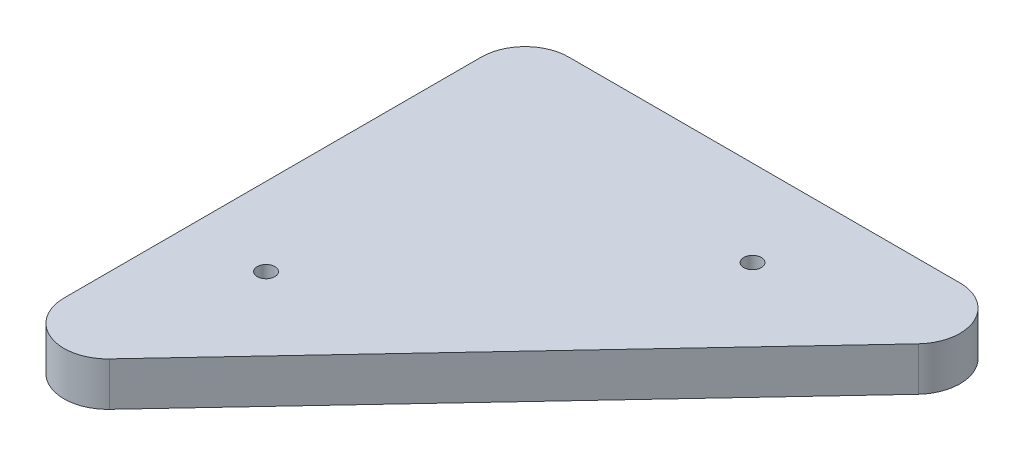
ISO-10303-21;
HEADER;
FILE_DESCRIPTION(('STEP AP214'),'2;1');
FILE_NAME('part.step','',(''),(''),'','','');
FILE_SCHEMA(('AUTOMOTIVE_DESIGN { 1 0 10303 214 1 1 1 1 }'));
ENDSEC;
DATA;
#1=APPLICATION_CONTEXT('core data for automotive mechanical design processes');
#2=APPLICATION_PROTOCOL_DEFINITION('international standard','automotive_design',2000,#1);
#3=PRODUCT_CONTEXT('',#1,'mechanical');
#4=PRODUCT('Part','Part','',(#3));
#5=PRODUCT_RELATED_PRODUCT_CATEGORY('part','',(#4));
#6=PRODUCT_DEFINITION_FORMATION('','',#4);
#7=PRODUCT_DEFINITION_CONTEXT('part definition',#1,'design');
#8=PRODUCT_DEFINITION('design','',#6,#7);
#9=PRODUCT_DEFINITION_SHAPE('','',#8);
#10=(LENGTH_UNIT() NAMED_UNIT(*) SI_UNIT(.MILLI.,.METRE.));
#11=(NAMED_UNIT(*) PLANE_ANGLE_UNIT() SI_UNIT($,.RADIAN.));
#12=(NAMED_UNIT(*) SI_UNIT($,.STERADIAN.) SOLID_ANGLE_UNIT());
#13=UNCERTAINTY_MEASURE_WITH_UNIT(LENGTH_MEASURE(1.E-05),#10,'distance_accuracy_value','');
#14=(GEOMETRIC_REPRESENTATION_CONTEXT(3) GLOBAL_UNCERTAINTY_ASSIGNED_CONTEXT((#13)) GLOBAL_UNIT_ASSIGNED_CONTEXT((#10,
#11,#12)) REPRESENTATION_CONTEXT('',''));
#15=CARTESIAN_POINT('',(0.,0.,0.));
#16=DIRECTION('',(0.,0.,1.));
#17=DIRECTION('',(1.,0.,0.));
#18=AXIS2_PLACEMENT_3D('',#15,#16,#17);
#19=CARTESIAN_POINT('',(0.,12.7,-121.25));
#20=DIRECTION('',(0.,-1.,0.));
#21=DIRECTION('',(0.,0.,-1.));
#22=AXIS2_PLACEMENT_3D('',#19,#20,#21);
#23=CYLINDRICAL_SURFACE('',#22,12.7);
#24=CARTESIAN_POINT('',(0.,0.,-121.25));
#25=DIRECTION('',(0.,1.,0.));
#26=DIRECTION('',(0.,0.,1.));
#27=AXIS2_PLACEMENT_3D('',#24,#25,#26);
#28=CIRCLE('',#27,12.7);
#29=CARTESIAN_POINT('',(0.,0.,-133.95));
#30=VERTEX_POINT('',#29);
#31=CARTESIAN_POINT('',(-12.7,0.,-121.25));
#32=VERTEX_POINT('',#31);
#33=EDGE_CURVE('E119',#30,#32,#28,.T.);
#34=ORIENTED_EDGE('',*,*,#33,.T.);
#35=DIRECTION('',(0.,-1.,0.));
#36=VECTOR('',#35,1.);
#37=CARTESIAN_POINT('',(-12.7,12.7,-121.25));
#38=LINE('',#37,#36);
#39=CARTESIAN_POINT('',(-12.7,12.7,-121.25));
#40=VERTEX_POINT('',#39);
#41=EDGE_CURVE('E11',#40,#32,#38,.T.);
#42=ORIENTED_EDGE('',*,*,#41,.F.);
#43=CARTESIAN_POINT('',(0.,12.7,-121.25));
#44=DIRECTION('',(0.,1.,0.));
#45=DIRECTION('',(0.,0.,1.));
#46=AXIS2_PLACEMENT_3D('',#43,#44,#45);
#47=CIRCLE('',#46,12.7);
#48=CARTESIAN_POINT('',(0.,12.7,-133.95));
#49=VERTEX_POINT('',#48);
#50=EDGE_CURVE('E130',#49,#40,#47,.T.);
#51=ORIENTED_EDGE('',*,*,#50,.F.);
#52=DIRECTION('',(0.,-1.,0.));
#53=VECTOR('',#52,1.);
#54=CARTESIAN_POINT('',(0.,12.7,-133.95));
#55=LINE('',#54,#53);
#56=EDGE_CURVE('E115',#49,#30,#55,.T.);
#57=ORIENTED_EDGE('',*,*,#56,.T.);
#58=EDGE_LOOP('',(#34,#42,#51,#57));
#59=FACE_BOUND('',#58,.T.);
#60=ADVANCED_FACE('F35',(#59),#23,.T.);
#61=CARTESIAN_POINT('',(-12.7,12.7,-121.25));
#62=DIRECTION('',(1.,0.,0.));
#63=DIRECTION('',(0.,0.,-1.));
#64=AXIS2_PLACEMENT_3D('',#61,#62,#63);
#65=PLANE('',#64);
#66=DIRECTION('',(0.,0.,1.));
#67=VECTOR('',#66,1.);
#68=CARTESIAN_POINT('',(-12.7,0.,-121.25));
#69=LINE('',#68,#67);
#70=CARTESIAN_POINT('',(-12.7,0.,0.));
#71=VERTEX_POINT('',#70);
#72=EDGE_CURVE('E122',#32,#71,#69,.T.);
#73=ORIENTED_EDGE('',*,*,#72,.T.);
#74=DIRECTION('',(0.,-1.,0.));
#75=VECTOR('',#74,1.);
#76=CARTESIAN_POINT('',(-12.7,12.7,0.));
#77=LINE('',#76,#75);
#78=CARTESIAN_POINT('',(-12.7,12.7,0.));
#79=VERTEX_POINT('',#78);
#80=EDGE_CURVE('E43',#79,#71,#77,.T.);
#81=ORIENTED_EDGE('',*,*,#80,.F.);
#82=DIRECTION('',(0.,0.,1.));
#83=VECTOR('',#82,1.);
#84=CARTESIAN_POINT('',(-12.7,12.7,-121.25));
#85=LINE('',#84,#83);
#86=EDGE_CURVE('E88',#40,#79,#85,.T.);
#87=ORIENTED_EDGE('',*,*,#86,.F.);
#88=ORIENTED_EDGE('',*,*,#41,.T.);
#89=EDGE_LOOP('',(#73,#81,#87,#88));
#90=FACE_BOUND('',#89,.T.);
#91=ADVANCED_FACE('F156',(#90),#65,.F.);
#92=CARTESIAN_POINT('',(0.,12.7,0.));
#93=DIRECTION('',(0.,-1.,0.));
#94=DIRECTION('',(0.,0.,-1.));
#95=AXIS2_PLACEMENT_3D('',#92,#93,#94);
#96=CYLINDRICAL_SURFACE('',#95,12.7);
#97=CARTESIAN_POINT('',(0.,0.,0.));
#98=DIRECTION('',(0.,1.,0.));
#99=DIRECTION('',(0.,0.,1.));
#100=AXIS2_PLACEMENT_3D('',#97,#98,#99);
#101=CIRCLE('',#100,12.7);
#102=CARTESIAN_POINT('',(9.26519398142731,0.,8.68597608139252));
#103=VERTEX_POINT('',#102);
#104=EDGE_CURVE('E125',#71,#103,#101,.T.);
#105=ORIENTED_EDGE('',*,*,#104,.T.);
#106=DIRECTION('',(0.,-1.,0.));
#107=VECTOR('',#106,1.);
#108=CARTESIAN_POINT('',(9.26519398142731,12.7,8.68597608139252));
#109=LINE('',#108,#107);
#110=CARTESIAN_POINT('',(9.26519398142731,12.7,8.68597608139252));
#111=VERTEX_POINT('',#110);
#112=EDGE_CURVE('E110',#111,#103,#109,.T.);
#113=ORIENTED_EDGE('',*,*,#112,.F.);
#114=CARTESIAN_POINT('',(0.,12.7,0.));
#115=DIRECTION('',(0.,1.,0.));
#116=DIRECTION('',(0.,0.,1.));
#117=AXIS2_PLACEMENT_3D('',#114,#115,#116);
#118=CIRCLE('',#117,12.7);
#119=EDGE_CURVE('E101',#79,#111,#118,.T.);
#120=ORIENTED_EDGE('',*,*,#119,.F.);
#121=ORIENTED_EDGE('',*,*,#80,.T.);
#122=EDGE_LOOP('',(#105,#113,#120,#121));
#123=FACE_BOUND('',#122,.T.);
#124=ADVANCED_FACE('F136',(#123),#96,.T.);
#125=CARTESIAN_POINT('',(9.26519398142731,12.7,8.68597608139252));
#126=DIRECTION('',(-0.729542833183253,0.,-0.683935124519096));
#127=DIRECTION('',(-0.683935124519096,0.,0.729542833183253));
#128=AXIS2_PLACEMENT_3D('',#125,#126,#127);
#129=PLANE('',#128);
#130=DIRECTION('',(0.683935124519096,0.,-0.729542833183253));
#131=VECTOR('',#130,1.);
#132=CARTESIAN_POINT('',(9.26519398142731,0.,8.68597608139252));
#133=LINE('',#132,#131);
#134=CARTESIAN_POINT('',(122.935193981427,0.,-112.564023918607));
#135=VERTEX_POINT('',#134);
#136=EDGE_CURVE('E109',#103,#135,#133,.T.);
#137=ORIENTED_EDGE('',*,*,#136,.T.);
#138=DIRECTION('',(0.,-1.,0.));
#139=VECTOR('',#138,1.);
#140=CARTESIAN_POINT('',(122.935193981427,12.7,-112.564023918607));
#141=LINE('',#140,#139);
#142=CARTESIAN_POINT('',(122.935193981427,12.7,-112.564023918607));
#143=VERTEX_POINT('',#142);
#144=EDGE_CURVE('E106',#143,#135,#141,.T.);
#145=ORIENTED_EDGE('',*,*,#144,.F.);
#146=DIRECTION('',(0.683935124519096,0.,-0.729542833183253));
#147=VECTOR('',#146,1.);
#148=CARTESIAN_POINT('',(9.26519398142731,12.7,8.68597608139252));
#149=LINE('',#148,#147);
#150=EDGE_CURVE('E95',#111,#143,#149,.T.);
#151=ORIENTED_EDGE('',*,*,#150,.F.);
#152=ORIENTED_EDGE('',*,*,#112,.T.);
#153=EDGE_LOOP('',(#137,#145,#151,#152));
#154=FACE_BOUND('',#153,.T.);
#155=ADVANCED_FACE('F107',(#154),#129,.F.);
#156=CARTESIAN_POINT('',(113.67,12.7,-121.25));
#157=DIRECTION('',(0.,-1.,0.));
#158=DIRECTION('',(0.,0.,-1.));
#159=AXIS2_PLACEMENT_3D('',#156,#157,#158);
#160=CYLINDRICAL_SURFACE('',#159,12.7);
#161=CARTESIAN_POINT('',(113.67,0.,-121.25));
#162=DIRECTION('',(0.,1.,0.));
#163=DIRECTION('',(0.,0.,1.));
#164=AXIS2_PLACEMENT_3D('',#161,#162,#163);
#165=CIRCLE('',#164,12.7);
#166=CARTESIAN_POINT('',(113.67,0.,-133.95));
#167=VERTEX_POINT('',#166);
#168=EDGE_CURVE('E74',#135,#167,#165,.T.);
#169=ORIENTED_EDGE('',*,*,#168,.T.);
#170=DIRECTION('',(0.,-1.,0.));
#171=VECTOR('',#170,1.);
#172=CARTESIAN_POINT('',(113.67,12.7,-133.95));
#173=LINE('',#172,#171);
#174=CARTESIAN_POINT('',(113.67,12.7,-133.95));
#175=VERTEX_POINT('',#174);
#176=EDGE_CURVE('E111',#175,#167,#173,.T.);
#177=ORIENTED_EDGE('',*,*,#176,.F.);
#178=CARTESIAN_POINT('',(113.67,12.7,-121.25));
#179=DIRECTION('',(0.,1.,0.));
#180=DIRECTION('',(0.,0.,1.));
#181=AXIS2_PLACEMENT_3D('',#178,#179,#180);
#182=CIRCLE('',#181,12.7);
#183=EDGE_CURVE('E99',#143,#175,#182,.T.);
#184=ORIENTED_EDGE('',*,*,#183,.F.);
#185=ORIENTED_EDGE('',*,*,#144,.T.);
#186=EDGE_LOOP('',(#169,#177,#184,#185));
#187=FACE_BOUND('',#186,.T.);
#188=ADVANCED_FACE('F113',(#187),#160,.T.);
#189=CARTESIAN_POINT('',(0.,12.7,-133.95));
#190=DIRECTION('',(0.,0.,1.));
#191=DIRECTION('',(1.,0.,0.));
#192=AXIS2_PLACEMENT_3D('',#189,#190,#191);
#193=PLANE('',#192);
#194=DIRECTION('',(-1.,0.,0.));
#195=VECTOR('',#194,1.);
#196=CARTESIAN_POINT('',(0.,0.,-133.95));
#197=LINE('',#196,#195);
#198=EDGE_CURVE('E80',#167,#30,#197,.T.);
#199=ORIENTED_EDGE('',*,*,#198,.T.);
#200=ORIENTED_EDGE('',*,*,#56,.F.);
#201=DIRECTION('',(-1.,0.,0.));
#202=VECTOR('',#201,1.);
#203=CARTESIAN_POINT('',(0.,12.7,-133.95));
#204=LINE('',#203,#202);
#205=EDGE_CURVE('E51',#175,#49,#204,.T.);
#206=ORIENTED_EDGE('',*,*,#205,.F.);
#207=ORIENTED_EDGE('',*,*,#176,.T.);
#208=EDGE_LOOP('',(#199,#200,#206,#207));
#209=FACE_BOUND('',#208,.T.);
#210=ADVANCED_FACE('F143',(#209),#193,.F.);
#211=CARTESIAN_POINT('',(0.,12.7,-121.25));
#212=DIRECTION('',(0.,1.,0.));
#213=DIRECTION('',(0.,0.,1.));
#214=AXIS2_PLACEMENT_3D('',#211,#212,#213);
#215=PLANE('',#214);
#216=CARTESIAN_POINT('',(10.0184271620582,12.7,-35.9812953796627));
#217=DIRECTION('',(0.,1.,0.));
#218=DIRECTION('',(0.,0.,1.));
#219=AXIS2_PLACEMENT_3D('',#216,#217,#218);
#220=CIRCLE('',#219,2.55269999999999);
#221=CARTESIAN_POINT('',(10.0184271620582,12.7,-33.4285953796627));
#222=VERTEX_POINT('',#221);
#223=EDGE_CURVE('E218',#222,#222,#220,.T.);
#224=ORIENTED_EDGE('',*,*,#223,.F.);
#225=EDGE_LOOP('',(#224));
#226=FACE_BOUND('',#225,.T.);
#227=CARTESIAN_POINT('',(78.4119396139678,12.7,-108.935578697988));
#228=DIRECTION('',(0.,1.,0.));
#229=DIRECTION('',(0.,0.,1.));
#230=AXIS2_PLACEMENT_3D('',#227,#228,#229);
#231=CIRCLE('',#230,2.55269999999999);
#232=CARTESIAN_POINT('',(78.4119396139678,12.7,-106.382878697988));
#233=VERTEX_POINT('',#232);
#234=EDGE_CURVE('E222',#233,#233,#231,.T.);
#235=ORIENTED_EDGE('',*,*,#234,.F.);
#236=EDGE_LOOP('',(#235));
#237=FACE_BOUND('',#236,.T.);
#238=ORIENTED_EDGE('',*,*,#50,.T.);
#239=ORIENTED_EDGE('',*,*,#86,.T.);
#240=ORIENTED_EDGE('',*,*,#119,.T.);
#241=ORIENTED_EDGE('',*,*,#150,.T.);
#242=ORIENTED_EDGE('',*,*,#183,.T.);
#243=ORIENTED_EDGE('',*,*,#205,.T.);
#244=EDGE_LOOP('',(#238,#239,#240,#241,#242,#243));
#245=FACE_BOUND('',#244,.T.);
#246=ADVANCED_FACE('F97',(#226,#237,#245),#215,.T.);
#247=CARTESIAN_POINT('',(0.,0.,-121.25));
#248=DIRECTION('',(0.,1.,0.));
#249=DIRECTION('',(0.,0.,1.));
#250=AXIS2_PLACEMENT_3D('',#247,#248,#249);
#251=PLANE('',#250);
#252=CARTESIAN_POINT('',(10.0184271620582,0.,-35.9812953796627));
#253=DIRECTION('',(0.,1.,0.));
#254=DIRECTION('',(0.,0.,1.));
#255=AXIS2_PLACEMENT_3D('',#252,#253,#254);
#256=CIRCLE('',#255,2.55269999999999);
#257=CARTESIAN_POINT('',(10.0184271620582,0.,-33.4285953796627));
#258=VERTEX_POINT('',#257);
#259=EDGE_CURVE('E221',#258,#258,#256,.T.);
#260=ORIENTED_EDGE('',*,*,#259,.T.);
#261=EDGE_LOOP('',(#260));
#262=FACE_BOUND('',#261,.T.);
#263=CARTESIAN_POINT('',(78.4119396139678,0.,-108.935578697988));
#264=DIRECTION('',(0.,1.,0.));
#265=DIRECTION('',(0.,0.,1.));
#266=AXIS2_PLACEMENT_3D('',#263,#264,#265);
#267=CIRCLE('',#266,2.55269999999999);
#268=CARTESIAN_POINT('',(78.4119396139678,0.,-106.382878697988));
#269=VERTEX_POINT('',#268);
#270=EDGE_CURVE('E123',#269,#269,#267,.T.);
#271=ORIENTED_EDGE('',*,*,#270,.T.);
#272=EDGE_LOOP('',(#271));
#273=FACE_BOUND('',#272,.T.);
#274=ORIENTED_EDGE('',*,*,#33,.F.);
#275=ORIENTED_EDGE('',*,*,#198,.F.);
#276=ORIENTED_EDGE('',*,*,#168,.F.);
#277=ORIENTED_EDGE('',*,*,#136,.F.);
#278=ORIENTED_EDGE('',*,*,#104,.F.);
#279=ORIENTED_EDGE('',*,*,#72,.F.);
#280=EDGE_LOOP('',(#274,#275,#276,#277,#278,#279));
#281=FACE_BOUND('',#280,.T.);
#282=ADVANCED_FACE('F139',(#262,#273,#281),#251,.F.);
#283=CARTESIAN_POINT('',(78.4119396139678,12.7,-108.935578697988));
#284=DIRECTION('',(0.,1.,0.));
#285=DIRECTION('',(0.,0.,1.));
#286=AXIS2_PLACEMENT_3D('',#283,#284,#285);
#287=CYLINDRICAL_SURFACE('',#286,2.55269999999999);
#288=ORIENTED_EDGE('',*,*,#234,.T.);
#289=EDGE_LOOP('',(#288));
#290=FACE_BOUND('',#289,.T.);
#291=ORIENTED_EDGE('',*,*,#270,.F.);
#292=EDGE_LOOP('',(#291));
#293=FACE_BOUND('',#292,.T.);
#294=ADVANCED_FACE('F189',(#290,#293),#287,.F.);
#295=CARTESIAN_POINT('',(10.0184271620582,12.7,-35.9812953796627));
#296=DIRECTION('',(0.,1.,0.));
#297=DIRECTION('',(0.,0.,1.));
#298=AXIS2_PLACEMENT_3D('',#295,#296,#297);
#299=CYLINDRICAL_SURFACE('',#298,2.55269999999999);
#300=ORIENTED_EDGE('',*,*,#223,.T.);
#301=EDGE_LOOP('',(#300));
#302=FACE_BOUND('',#301,.T.);
#303=ORIENTED_EDGE('',*,*,#259,.F.);
#304=EDGE_LOOP('',(#303));
#305=FACE_BOUND('',#304,.T.);
#306=ADVANCED_FACE('F198',(#302,#305),#299,.F.);
#307=CLOSED_SHELL('',(#60,#91,#124,#155,#188,#210,#246,#282,#294,#306));
#308=MANIFOLD_SOLID_BREP('B2',#307);
#309=ADVANCED_BREP_SHAPE_REPRESENTATION('',(#18,#308),#14);
#310=SHAPE_DEFINITION_REPRESENTATION(#9,#309);
ENDSEC;
END-ISO-10303-21;
